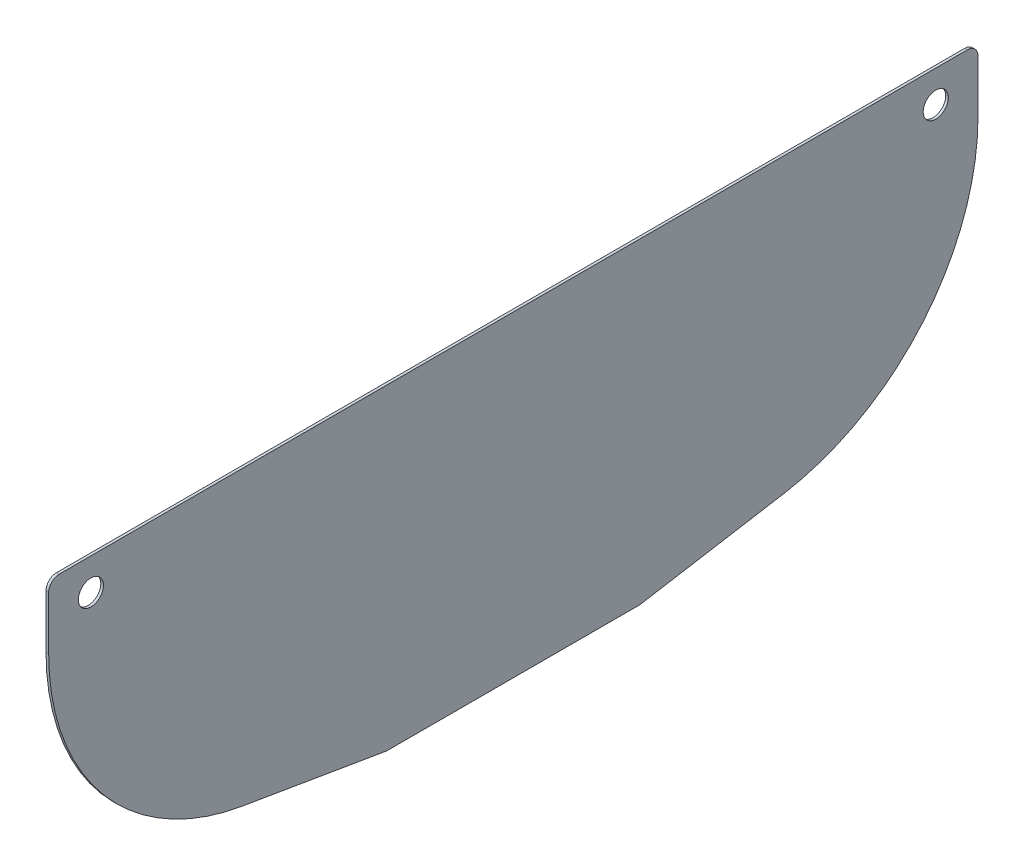
ISO-10303-21;
HEADER;
FILE_DESCRIPTION(('STEP AP214'),'2;1');
FILE_NAME('part.step','',(''),(''),'','','');
FILE_SCHEMA(('AUTOMOTIVE_DESIGN { 1 0 10303 214 1 1 1 1 }'));
ENDSEC;
DATA;
#1=APPLICATION_CONTEXT('core data for automotive mechanical design processes');
#2=APPLICATION_PROTOCOL_DEFINITION('international standard','automotive_design',2000,#1);
#3=PRODUCT_CONTEXT('',#1,'mechanical');
#4=PRODUCT('Part','Part','',(#3));
#5=PRODUCT_RELATED_PRODUCT_CATEGORY('part','',(#4));
#6=PRODUCT_DEFINITION_FORMATION('','',#4);
#7=PRODUCT_DEFINITION_CONTEXT('part definition',#1,'design');
#8=PRODUCT_DEFINITION('design','',#6,#7);
#9=PRODUCT_DEFINITION_SHAPE('','',#8);
#10=(LENGTH_UNIT() NAMED_UNIT(*) SI_UNIT(.MILLI.,.METRE.));
#11=(NAMED_UNIT(*) PLANE_ANGLE_UNIT() SI_UNIT($,.RADIAN.));
#12=(NAMED_UNIT(*) SI_UNIT($,.STERADIAN.) SOLID_ANGLE_UNIT());
#13=UNCERTAINTY_MEASURE_WITH_UNIT(LENGTH_MEASURE(1.E-05),#10,'distance_accuracy_value','');
#14=(GEOMETRIC_REPRESENTATION_CONTEXT(3) GLOBAL_UNCERTAINTY_ASSIGNED_CONTEXT((#13)) GLOBAL_UNIT_ASSIGNED_CONTEXT((#10,
#11,#12)) REPRESENTATION_CONTEXT('',''));
#15=CARTESIAN_POINT('',(0.,0.,0.));
#16=DIRECTION('',(0.,0.,1.));
#17=DIRECTION('',(1.,0.,0.));
#18=AXIS2_PLACEMENT_3D('',#15,#16,#17);
#19=CARTESIAN_POINT('',(3.175,609.6,-279.4));
#20=DIRECTION('',(1.,0.,0.));
#21=DIRECTION('',(0.,0.,-1.));
#22=AXIS2_PLACEMENT_3D('',#19,#20,#21);
#23=PLANE('',#22);
#24=CARTESIAN_POINT('',(3.175,647.7,508.));
#25=DIRECTION('',(1.,0.,0.));
#26=DIRECTION('',(0.,0.,-1.));
#27=AXIS2_PLACEMENT_3D('',#24,#25,#26);
#28=CIRCLE('',#27,15.08125);
#29=CARTESIAN_POINT('',(3.175,647.7,492.91875));
#30=VERTEX_POINT('',#29);
#31=EDGE_CURVE('E240',#30,#30,#28,.T.);
#32=ORIENTED_EDGE('',*,*,#31,.F.);
#33=EDGE_LOOP('',(#32));
#34=FACE_BOUND('',#33,.T.);
#35=DIRECTION('',(0.,0.,-1.));
#36=VECTOR('',#35,1.);
#37=CARTESIAN_POINT('',(3.175,304.8,-152.4));
#38=LINE('',#37,#36);
#39=CARTESIAN_POINT('',(3.175,304.8,151.335296477196));
#40=VERTEX_POINT('',#39);
#41=CARTESIAN_POINT('',(3.175,304.8,-151.335296477196));
#42=VERTEX_POINT('',#41);
#43=EDGE_CURVE('E233',#40,#42,#38,.T.);
#44=ORIENTED_EDGE('',*,*,#43,.T.);
#45=CARTESIAN_POINT('',(3.175,317.5,-151.335296477196));
#46=DIRECTION('',(1.,0.,0.));
#47=DIRECTION('',(0.,0.,-1.));
#48=AXIS2_PLACEMENT_3D('',#45,#46,#47);
#49=CIRCLE('',#48,12.7);
#50=CARTESIAN_POINT('',(3.175,304.977272750754,-153.449841875385));
#51=VERTEX_POINT('',#50);
#52=EDGE_CURVE('E179',#42,#51,#49,.T.);
#53=ORIENTED_EDGE('',*,*,#52,.T.);
#54=DIRECTION('',(0.,0.166499637652699,-0.986041515688625));
#55=VECTOR('',#54,1.);
#56=CARTESIAN_POINT('',(3.175,304.8,-152.4));
#57=LINE('',#56,#55);
#58=CARTESIAN_POINT('',(3.175,334.100000516598,-325.919998760164));
#59=VERTEX_POINT('',#58);
#60=EDGE_CURVE('E142',#51,#59,#57,.T.);
#61=ORIENTED_EDGE('',*,*,#60,.T.);
#62=CARTESIAN_POINT('',(3.175,609.6,-279.4));
#63=DIRECTION('',(1.,0.,0.));
#64=DIRECTION('',(0.,0.,-1.));
#65=AXIS2_PLACEMENT_3D('',#62,#63,#64);
#66=CIRCLE('',#65,279.4);
#67=CARTESIAN_POINT('',(3.175,609.6,-558.8));
#68=VERTEX_POINT('',#67);
#69=EDGE_CURVE('E136',#59,#68,#66,.T.);
#70=ORIENTED_EDGE('',*,*,#69,.T.);
#71=DIRECTION('',(0.,1.,0.));
#72=VECTOR('',#71,1.);
#73=CARTESIAN_POINT('',(3.175,685.8,-558.8));
#74=LINE('',#73,#72);
#75=CARTESIAN_POINT('',(3.175,673.1,-558.8));
#76=VERTEX_POINT('',#75);
#77=EDGE_CURVE('E126',#68,#76,#74,.T.);
#78=ORIENTED_EDGE('',*,*,#77,.T.);
#79=CARTESIAN_POINT('',(3.175,673.1,-546.1));
#80=DIRECTION('',(1.,0.,0.));
#81=DIRECTION('',(0.,0.,-1.));
#82=AXIS2_PLACEMENT_3D('',#79,#80,#81);
#83=CIRCLE('',#82,12.7);
#84=CARTESIAN_POINT('',(3.175,685.8,-546.1));
#85=VERTEX_POINT('',#84);
#86=EDGE_CURVE('E175',#76,#85,#83,.T.);
#87=ORIENTED_EDGE('',*,*,#86,.T.);
#88=DIRECTION('',(0.,0.,1.));
#89=VECTOR('',#88,1.);
#90=CARTESIAN_POINT('',(3.175,685.8,558.8));
#91=LINE('',#90,#89);
#92=CARTESIAN_POINT('',(3.175,685.8,546.1));
#93=VERTEX_POINT('',#92);
#94=EDGE_CURVE('E135',#85,#93,#91,.T.);
#95=ORIENTED_EDGE('',*,*,#94,.T.);
#96=CARTESIAN_POINT('',(3.175,673.1,546.1));
#97=DIRECTION('',(1.,0.,0.));
#98=DIRECTION('',(0.,0.,-1.));
#99=AXIS2_PLACEMENT_3D('',#96,#97,#98);
#100=CIRCLE('',#99,12.7);
#101=CARTESIAN_POINT('',(3.175,673.1,558.8));
#102=VERTEX_POINT('',#101);
#103=EDGE_CURVE('E57',#93,#102,#100,.T.);
#104=ORIENTED_EDGE('',*,*,#103,.T.);
#105=DIRECTION('',(0.,-1.,0.));
#106=VECTOR('',#105,1.);
#107=CARTESIAN_POINT('',(3.175,609.6,558.8));
#108=LINE('',#107,#106);
#109=CARTESIAN_POINT('',(3.175,609.6,558.8));
#110=VERTEX_POINT('',#109);
#111=EDGE_CURVE('E254',#102,#110,#108,.T.);
#112=ORIENTED_EDGE('',*,*,#111,.T.);
#113=CARTESIAN_POINT('',(3.175,609.6,279.4));
#114=DIRECTION('',(1.,0.,0.));
#115=DIRECTION('',(0.,0.,1.));
#116=AXIS2_PLACEMENT_3D('',#113,#114,#115);
#117=CIRCLE('',#116,279.4);
#118=CARTESIAN_POINT('',(3.175,334.100000516598,325.919998760164));
#119=VERTEX_POINT('',#118);
#120=EDGE_CURVE('E237',#110,#119,#117,.T.);
#121=ORIENTED_EDGE('',*,*,#120,.T.);
#122=DIRECTION('',(0.,-0.166499637652699,-0.986041515688625));
#123=VECTOR('',#122,1.);
#124=CARTESIAN_POINT('',(3.175,304.8,152.4));
#125=LINE('',#124,#123);
#126=CARTESIAN_POINT('',(3.175,304.977272750754,153.449841875385));
#127=VERTEX_POINT('',#126);
#128=EDGE_CURVE('E220',#119,#127,#125,.T.);
#129=ORIENTED_EDGE('',*,*,#128,.T.);
#130=CARTESIAN_POINT('',(3.175,317.5,151.335296477196));
#131=DIRECTION('',(1.,0.,0.));
#132=DIRECTION('',(0.,0.,-1.));
#133=AXIS2_PLACEMENT_3D('',#130,#131,#132);
#134=CIRCLE('',#133,12.7);
#135=EDGE_CURVE('E177',#127,#40,#134,.T.);
#136=ORIENTED_EDGE('',*,*,#135,.T.);
#137=EDGE_LOOP('',(#44,#53,#61,#70,#78,#87,#95,#104,#112,#121,#129,#136));
#138=FACE_BOUND('',#137,.T.);
#139=CARTESIAN_POINT('',(3.175,647.7,-508.));
#140=DIRECTION('',(1.,0.,0.));
#141=DIRECTION('',(0.,0.,-1.));
#142=AXIS2_PLACEMENT_3D('',#139,#140,#141);
#143=CIRCLE('',#142,15.0812500000001);
#144=CARTESIAN_POINT('',(3.175,647.7,-523.08125));
#145=VERTEX_POINT('',#144);
#146=EDGE_CURVE('E247',#145,#145,#143,.T.);
#147=ORIENTED_EDGE('',*,*,#146,.F.);
#148=EDGE_LOOP('',(#147));
#149=FACE_BOUND('',#148,.T.);
#150=ADVANCED_FACE('F34',(#34,#138,#149),#23,.T.);
#151=CARTESIAN_POINT('',(0.,609.6,-279.4));
#152=DIRECTION('',(1.,0.,0.));
#153=DIRECTION('',(0.,0.,-1.));
#154=AXIS2_PLACEMENT_3D('',#151,#152,#153);
#155=PLANE('',#154);
#156=DIRECTION('',(0.,0.166499637652699,-0.986041515688625));
#157=VECTOR('',#156,1.);
#158=CARTESIAN_POINT('',(0.,304.8,-152.4));
#159=LINE('',#158,#157);
#160=CARTESIAN_POINT('',(0.,304.977272750754,-153.449841875385));
#161=VERTEX_POINT('',#160);
#162=CARTESIAN_POINT('',(0.,334.100000516598,-325.919998760164));
#163=VERTEX_POINT('',#162);
#164=EDGE_CURVE('E146',#161,#163,#159,.T.);
#165=ORIENTED_EDGE('',*,*,#164,.F.);
#166=CARTESIAN_POINT('',(0.,317.5,-151.335296477196));
#167=DIRECTION('',(1.,0.,0.));
#168=DIRECTION('',(0.,0.,-1.));
#169=AXIS2_PLACEMENT_3D('',#166,#167,#168);
#170=CIRCLE('',#169,12.7);
#171=CARTESIAN_POINT('',(0.,304.8,-151.335296477196));
#172=VERTEX_POINT('',#171);
#173=EDGE_CURVE('E167',#161,#172,#170,.F.);
#174=ORIENTED_EDGE('',*,*,#173,.T.);
#175=DIRECTION('',(0.,0.,-1.));
#176=VECTOR('',#175,1.);
#177=CARTESIAN_POINT('',(0.,304.8,-152.4));
#178=LINE('',#177,#176);
#179=CARTESIAN_POINT('',(0.,304.8,151.335296477196));
#180=VERTEX_POINT('',#179);
#181=EDGE_CURVE('E211',#180,#172,#178,.T.);
#182=ORIENTED_EDGE('',*,*,#181,.F.);
#183=CARTESIAN_POINT('',(0.,317.5,151.335296477196));
#184=DIRECTION('',(1.,0.,0.));
#185=DIRECTION('',(0.,0.,-1.));
#186=AXIS2_PLACEMENT_3D('',#183,#184,#185);
#187=CIRCLE('',#186,12.7);
#188=CARTESIAN_POINT('',(0.,304.977272750754,153.449841875385));
#189=VERTEX_POINT('',#188);
#190=EDGE_CURVE('E165',#180,#189,#187,.F.);
#191=ORIENTED_EDGE('',*,*,#190,.T.);
#192=DIRECTION('',(0.,-0.166499637652699,-0.986041515688625));
#193=VECTOR('',#192,1.);
#194=CARTESIAN_POINT('',(0.,304.8,152.4));
#195=LINE('',#194,#193);
#196=CARTESIAN_POINT('',(0.,334.100000516598,325.919998760164));
#197=VERTEX_POINT('',#196);
#198=EDGE_CURVE('E209',#197,#189,#195,.T.);
#199=ORIENTED_EDGE('',*,*,#198,.F.);
#200=CARTESIAN_POINT('',(0.,609.6,279.4));
#201=DIRECTION('',(1.,0.,0.));
#202=DIRECTION('',(0.,0.,1.));
#203=AXIS2_PLACEMENT_3D('',#200,#201,#202);
#204=CIRCLE('',#203,279.4);
#205=CARTESIAN_POINT('',(0.,609.6,558.8));
#206=VERTEX_POINT('',#205);
#207=EDGE_CURVE('E203',#206,#197,#204,.T.);
#208=ORIENTED_EDGE('',*,*,#207,.F.);
#209=DIRECTION('',(0.,-1.,0.));
#210=VECTOR('',#209,1.);
#211=CARTESIAN_POINT('',(0.,609.6,558.8));
#212=LINE('',#211,#210);
#213=CARTESIAN_POINT('',(0.,673.1,558.8));
#214=VERTEX_POINT('',#213);
#215=EDGE_CURVE('E200',#214,#206,#212,.T.);
#216=ORIENTED_EDGE('',*,*,#215,.F.);
#217=CARTESIAN_POINT('',(0.,673.1,546.1));
#218=DIRECTION('',(1.,0.,0.));
#219=DIRECTION('',(0.,0.,-1.));
#220=AXIS2_PLACEMENT_3D('',#217,#218,#219);
#221=CIRCLE('',#220,12.7);
#222=CARTESIAN_POINT('',(0.,685.8,546.1));
#223=VERTEX_POINT('',#222);
#224=EDGE_CURVE('E155',#214,#223,#221,.F.);
#225=ORIENTED_EDGE('',*,*,#224,.T.);
#226=DIRECTION('',(0.,0.,1.));
#227=VECTOR('',#226,1.);
#228=CARTESIAN_POINT('',(0.,685.8,558.8));
#229=LINE('',#228,#227);
#230=CARTESIAN_POINT('',(0.,685.8,-546.1));
#231=VERTEX_POINT('',#230);
#232=EDGE_CURVE('E192',#231,#223,#229,.T.);
#233=ORIENTED_EDGE('',*,*,#232,.F.);
#234=CARTESIAN_POINT('',(0.,673.1,-546.1));
#235=DIRECTION('',(1.,0.,0.));
#236=DIRECTION('',(0.,0.,-1.));
#237=AXIS2_PLACEMENT_3D('',#234,#235,#236);
#238=CIRCLE('',#237,12.7);
#239=CARTESIAN_POINT('',(0.,673.1,-558.8));
#240=VERTEX_POINT('',#239);
#241=EDGE_CURVE('E163',#231,#240,#238,.F.);
#242=ORIENTED_EDGE('',*,*,#241,.T.);
#243=DIRECTION('',(0.,1.,0.));
#244=VECTOR('',#243,1.);
#245=CARTESIAN_POINT('',(0.,685.8,-558.8));
#246=LINE('',#245,#244);
#247=CARTESIAN_POINT('',(0.,609.6,-558.8));
#248=VERTEX_POINT('',#247);
#249=EDGE_CURVE('E201',#248,#240,#246,.T.);
#250=ORIENTED_EDGE('',*,*,#249,.F.);
#251=CARTESIAN_POINT('',(0.,609.6,-279.4));
#252=DIRECTION('',(1.,0.,0.));
#253=DIRECTION('',(0.,0.,-1.));
#254=AXIS2_PLACEMENT_3D('',#251,#252,#253);
#255=CIRCLE('',#254,279.4);
#256=EDGE_CURVE('E150',#163,#248,#255,.T.);
#257=ORIENTED_EDGE('',*,*,#256,.F.);
#258=EDGE_LOOP('',(#165,#174,#182,#191,#199,#208,#216,#225,#233,#242,#250,#257));
#259=FACE_BOUND('',#258,.T.);
#260=CARTESIAN_POINT('',(0.,647.7,508.));
#261=DIRECTION('',(1.,0.,0.));
#262=DIRECTION('',(0.,0.,-1.));
#263=AXIS2_PLACEMENT_3D('',#260,#261,#262);
#264=CIRCLE('',#263,15.08125);
#265=CARTESIAN_POINT('',(0.,647.7,492.91875));
#266=VERTEX_POINT('',#265);
#267=EDGE_CURVE('E242',#266,#266,#264,.T.);
#268=ORIENTED_EDGE('',*,*,#267,.T.);
#269=EDGE_LOOP('',(#268));
#270=FACE_BOUND('',#269,.T.);
#271=CARTESIAN_POINT('',(0.,647.7,-508.));
#272=DIRECTION('',(1.,0.,0.));
#273=DIRECTION('',(0.,0.,-1.));
#274=AXIS2_PLACEMENT_3D('',#271,#272,#273);
#275=CIRCLE('',#274,15.0812500000001);
#276=CARTESIAN_POINT('',(0.,647.7,-523.08125));
#277=VERTEX_POINT('',#276);
#278=EDGE_CURVE('E250',#277,#277,#275,.T.);
#279=ORIENTED_EDGE('',*,*,#278,.T.);
#280=EDGE_LOOP('',(#279));
#281=FACE_BOUND('',#280,.T.);
#282=ADVANCED_FACE('F197',(#259,#270,#281),#155,.F.);
#283=CARTESIAN_POINT('',(3.175,609.6,-279.4));
#284=DIRECTION('',(-1.,0.,0.));
#285=DIRECTION('',(0.,0.,1.));
#286=AXIS2_PLACEMENT_3D('',#283,#284,#285);
#287=CYLINDRICAL_SURFACE('',#286,279.4);
#288=ORIENTED_EDGE('',*,*,#256,.T.);
#289=DIRECTION('',(-1.,0.,0.));
#290=VECTOR('',#289,1.);
#291=CARTESIAN_POINT('',(3.175,609.6,-558.8));
#292=LINE('',#291,#290);
#293=EDGE_CURVE('E131',#68,#248,#292,.T.);
#294=ORIENTED_EDGE('',*,*,#293,.F.);
#295=ORIENTED_EDGE('',*,*,#69,.F.);
#296=DIRECTION('',(-1.,0.,0.));
#297=VECTOR('',#296,1.);
#298=CARTESIAN_POINT('',(3.175,334.100000516598,-325.919998760164));
#299=LINE('',#298,#297);
#300=EDGE_CURVE('E215',#59,#163,#299,.T.);
#301=ORIENTED_EDGE('',*,*,#300,.T.);
#302=EDGE_LOOP('',(#288,#294,#295,#301));
#303=FACE_BOUND('',#302,.T.);
#304=ADVANCED_FACE('F148',(#303),#287,.T.);
#305=CARTESIAN_POINT('',(3.175,685.8,-558.8));
#306=DIRECTION('',(0.,0.,1.));
#307=DIRECTION('',(0.,-1.,0.));
#308=AXIS2_PLACEMENT_3D('',#305,#306,#307);
#309=PLANE('',#308);
#310=ORIENTED_EDGE('',*,*,#249,.T.);
#311=DIRECTION('',(-1.,0.,0.));
#312=VECTOR('',#311,1.);
#313=CARTESIAN_POINT('',(3.175,673.1,-558.8));
#314=LINE('',#313,#312);
#315=EDGE_CURVE('E42',#240,#76,#314,.F.);
#316=ORIENTED_EDGE('',*,*,#315,.T.);
#317=ORIENTED_EDGE('',*,*,#77,.F.);
#318=ORIENTED_EDGE('',*,*,#293,.T.);
#319=EDGE_LOOP('',(#310,#316,#317,#318));
#320=FACE_BOUND('',#319,.T.);
#321=ADVANCED_FACE('F129',(#320),#309,.F.);
#322=CARTESIAN_POINT('',(3.175,685.8,558.8));
#323=DIRECTION('',(0.,-1.,0.));
#324=DIRECTION('',(0.,0.,-1.));
#325=AXIS2_PLACEMENT_3D('',#322,#323,#324);
#326=PLANE('',#325);
#327=ORIENTED_EDGE('',*,*,#94,.F.);
#328=DIRECTION('',(-1.,0.,0.));
#329=VECTOR('',#328,1.);
#330=CARTESIAN_POINT('',(3.175,685.8,-546.1));
#331=LINE('',#330,#329);
#332=EDGE_CURVE('E184',#85,#231,#331,.T.);
#333=ORIENTED_EDGE('',*,*,#332,.T.);
#334=ORIENTED_EDGE('',*,*,#232,.T.);
#335=DIRECTION('',(-1.,0.,0.));
#336=VECTOR('',#335,1.);
#337=CARTESIAN_POINT('',(3.175,685.8,546.1));
#338=LINE('',#337,#336);
#339=EDGE_CURVE('E182',#223,#93,#338,.F.);
#340=ORIENTED_EDGE('',*,*,#339,.T.);
#341=EDGE_LOOP('',(#327,#333,#334,#340));
#342=FACE_BOUND('',#341,.T.);
#343=ADVANCED_FACE('F191',(#342),#326,.F.);
#344=CARTESIAN_POINT('',(3.175,609.6,558.8));
#345=DIRECTION('',(0.,0.,-1.));
#346=DIRECTION('',(0.,1.,0.));
#347=AXIS2_PLACEMENT_3D('',#344,#345,#346);
#348=PLANE('',#347);
#349=ORIENTED_EDGE('',*,*,#111,.F.);
#350=DIRECTION('',(-1.,0.,0.));
#351=VECTOR('',#350,1.);
#352=CARTESIAN_POINT('',(3.175,673.1,558.8));
#353=LINE('',#352,#351);
#354=EDGE_CURVE('E11',#102,#214,#353,.T.);
#355=ORIENTED_EDGE('',*,*,#354,.T.);
#356=ORIENTED_EDGE('',*,*,#215,.T.);
#357=DIRECTION('',(-1.,0.,0.));
#358=VECTOR('',#357,1.);
#359=CARTESIAN_POINT('',(3.175,609.6,558.8));
#360=LINE('',#359,#358);
#361=EDGE_CURVE('E152',#110,#206,#360,.T.);
#362=ORIENTED_EDGE('',*,*,#361,.F.);
#363=EDGE_LOOP('',(#349,#355,#356,#362));
#364=FACE_BOUND('',#363,.T.);
#365=ADVANCED_FACE('F258',(#364),#348,.F.);
#366=CARTESIAN_POINT('',(3.175,609.6,279.4));
#367=DIRECTION('',(-1.,0.,0.));
#368=DIRECTION('',(0.,0.,1.));
#369=AXIS2_PLACEMENT_3D('',#366,#367,#368);
#370=CYLINDRICAL_SURFACE('',#369,279.4);
#371=ORIENTED_EDGE('',*,*,#207,.T.);
#372=DIRECTION('',(-1.,0.,0.));
#373=VECTOR('',#372,1.);
#374=CARTESIAN_POINT('',(3.175,334.100000516598,325.919998760164));
#375=LINE('',#374,#373);
#376=EDGE_CURVE('E158',#119,#197,#375,.T.);
#377=ORIENTED_EDGE('',*,*,#376,.F.);
#378=ORIENTED_EDGE('',*,*,#120,.F.);
#379=ORIENTED_EDGE('',*,*,#361,.T.);
#380=EDGE_LOOP('',(#371,#377,#378,#379));
#381=FACE_BOUND('',#380,.T.);
#382=ADVANCED_FACE('F256',(#381),#370,.T.);
#383=CARTESIAN_POINT('',(3.175,304.8,152.4));
#384=DIRECTION('',(0.,0.986041515688625,-0.166499637652699));
#385=DIRECTION('',(0.,0.166499637652699,0.986041515688625));
#386=AXIS2_PLACEMENT_3D('',#383,#384,#385);
#387=PLANE('',#386);
#388=ORIENTED_EDGE('',*,*,#198,.T.);
#389=DIRECTION('',(-1.,0.,0.));
#390=VECTOR('',#389,1.);
#391=CARTESIAN_POINT('',(3.175,304.977272750754,153.449841875385));
#392=LINE('',#391,#390);
#393=EDGE_CURVE('E49',#189,#127,#392,.F.);
#394=ORIENTED_EDGE('',*,*,#393,.T.);
#395=ORIENTED_EDGE('',*,*,#128,.F.);
#396=ORIENTED_EDGE('',*,*,#376,.T.);
#397=EDGE_LOOP('',(#388,#394,#395,#396));
#398=FACE_BOUND('',#397,.T.);
#399=ADVANCED_FACE('F219',(#398),#387,.F.);
#400=CARTESIAN_POINT('',(3.175,304.8,-152.4));
#401=DIRECTION('',(0.,1.,0.));
#402=DIRECTION('',(0.,0.,1.));
#403=AXIS2_PLACEMENT_3D('',#400,#401,#402);
#404=PLANE('',#403);
#405=ORIENTED_EDGE('',*,*,#181,.T.);
#406=DIRECTION('',(-1.,0.,0.));
#407=VECTOR('',#406,1.);
#408=CARTESIAN_POINT('',(3.175,304.8,-151.335296477196));
#409=LINE('',#408,#407);
#410=EDGE_CURVE('E172',#172,#42,#409,.F.);
#411=ORIENTED_EDGE('',*,*,#410,.T.);
#412=ORIENTED_EDGE('',*,*,#43,.F.);
#413=DIRECTION('',(-1.,0.,0.));
#414=VECTOR('',#413,1.);
#415=CARTESIAN_POINT('',(3.175,304.8,151.335296477196));
#416=LINE('',#415,#414);
#417=EDGE_CURVE('E169',#40,#180,#416,.T.);
#418=ORIENTED_EDGE('',*,*,#417,.T.);
#419=EDGE_LOOP('',(#405,#411,#412,#418));
#420=FACE_BOUND('',#419,.T.);
#421=ADVANCED_FACE('F231',(#420),#404,.F.);
#422=CARTESIAN_POINT('',(3.175,304.8,-152.4));
#423=DIRECTION('',(0.,0.986041515688625,0.166499637652699));
#424=DIRECTION('',(0.,-0.166499637652699,0.986041515688625));
#425=AXIS2_PLACEMENT_3D('',#422,#423,#424);
#426=PLANE('',#425);
#427=ORIENTED_EDGE('',*,*,#60,.F.);
#428=DIRECTION('',(-1.,0.,0.));
#429=VECTOR('',#428,1.);
#430=CARTESIAN_POINT('',(3.175,304.977272750754,-153.449841875385));
#431=LINE('',#430,#429);
#432=EDGE_CURVE('E151',#51,#161,#431,.T.);
#433=ORIENTED_EDGE('',*,*,#432,.T.);
#434=ORIENTED_EDGE('',*,*,#164,.T.);
#435=ORIENTED_EDGE('',*,*,#300,.F.);
#436=EDGE_LOOP('',(#427,#433,#434,#435));
#437=FACE_BOUND('',#436,.T.);
#438=ADVANCED_FACE('F280',(#437),#426,.F.);
#439=CARTESIAN_POINT('',(3.175,647.7,508.));
#440=DIRECTION('',(-1.,0.,0.));
#441=DIRECTION('',(0.,0.,1.));
#442=AXIS2_PLACEMENT_3D('',#439,#440,#441);
#443=CYLINDRICAL_SURFACE('',#442,15.08125);
#444=ORIENTED_EDGE('',*,*,#31,.T.);
#445=EDGE_LOOP('',(#444));
#446=FACE_BOUND('',#445,.T.);
#447=ORIENTED_EDGE('',*,*,#267,.F.);
#448=EDGE_LOOP('',(#447));
#449=FACE_BOUND('',#448,.T.);
#450=ADVANCED_FACE('F277',(#446,#449),#443,.F.);
#451=CARTESIAN_POINT('',(3.175,647.7,-508.));
#452=DIRECTION('',(-1.,0.,0.));
#453=DIRECTION('',(0.,0.,1.));
#454=AXIS2_PLACEMENT_3D('',#451,#452,#453);
#455=CYLINDRICAL_SURFACE('',#454,15.0812500000001);
#456=ORIENTED_EDGE('',*,*,#146,.T.);
#457=EDGE_LOOP('',(#456));
#458=FACE_BOUND('',#457,.T.);
#459=ORIENTED_EDGE('',*,*,#278,.F.);
#460=EDGE_LOOP('',(#459));
#461=FACE_BOUND('',#460,.T.);
#462=ADVANCED_FACE('F299',(#458,#461),#455,.F.);
#463=CARTESIAN_POINT('',(3.175,317.5,-151.335296477196));
#464=DIRECTION('',(-1.,0.,0.));
#465=DIRECTION('',(0.,0.,1.));
#466=AXIS2_PLACEMENT_3D('',#463,#464,#465);
#467=CYLINDRICAL_SURFACE('',#466,12.7);
#468=ORIENTED_EDGE('',*,*,#52,.F.);
#469=ORIENTED_EDGE('',*,*,#410,.F.);
#470=ORIENTED_EDGE('',*,*,#173,.F.);
#471=ORIENTED_EDGE('',*,*,#432,.F.);
#472=EDGE_LOOP('',(#468,#469,#470,#471));
#473=FACE_BOUND('',#472,.T.);
#474=ADVANCED_FACE('F267',(#473),#467,.T.);
#475=CARTESIAN_POINT('',(3.175,317.5,151.335296477196));
#476=DIRECTION('',(-1.,0.,0.));
#477=DIRECTION('',(0.,0.,1.));
#478=AXIS2_PLACEMENT_3D('',#475,#476,#477);
#479=CYLINDRICAL_SURFACE('',#478,12.7);
#480=ORIENTED_EDGE('',*,*,#135,.F.);
#481=ORIENTED_EDGE('',*,*,#393,.F.);
#482=ORIENTED_EDGE('',*,*,#190,.F.);
#483=ORIENTED_EDGE('',*,*,#417,.F.);
#484=EDGE_LOOP('',(#480,#481,#482,#483));
#485=FACE_BOUND('',#484,.T.);
#486=ADVANCED_FACE('F228',(#485),#479,.T.);
#487=CARTESIAN_POINT('',(3.175,673.1,-546.1));
#488=DIRECTION('',(-1.,0.,0.));
#489=DIRECTION('',(0.,0.,1.));
#490=AXIS2_PLACEMENT_3D('',#487,#488,#489);
#491=CYLINDRICAL_SURFACE('',#490,12.7);
#492=ORIENTED_EDGE('',*,*,#86,.F.);
#493=ORIENTED_EDGE('',*,*,#315,.F.);
#494=ORIENTED_EDGE('',*,*,#241,.F.);
#495=ORIENTED_EDGE('',*,*,#332,.F.);
#496=EDGE_LOOP('',(#492,#493,#494,#495));
#497=FACE_BOUND('',#496,.T.);
#498=ADVANCED_FACE('F261',(#497),#491,.T.);
#499=CARTESIAN_POINT('',(3.175,673.1,546.1));
#500=DIRECTION('',(-1.,0.,0.));
#501=DIRECTION('',(0.,0.,1.));
#502=AXIS2_PLACEMENT_3D('',#499,#500,#501);
#503=CYLINDRICAL_SURFACE('',#502,12.7);
#504=ORIENTED_EDGE('',*,*,#103,.F.);
#505=ORIENTED_EDGE('',*,*,#339,.F.);
#506=ORIENTED_EDGE('',*,*,#224,.F.);
#507=ORIENTED_EDGE('',*,*,#354,.F.);
#508=EDGE_LOOP('',(#504,#505,#506,#507));
#509=FACE_BOUND('',#508,.T.);
#510=ADVANCED_FACE('F36',(#509),#503,.T.);
#511=CLOSED_SHELL('',(#150,#282,#304,#321,#343,#365,#382,#399,#421,#438,#450,#462,#474,#486,
#498,#510));
#512=MANIFOLD_SOLID_BREP('B2',#511);
#513=ADVANCED_BREP_SHAPE_REPRESENTATION('',(#18,#512),#14);
#514=SHAPE_DEFINITION_REPRESENTATION(#9,#513);
ENDSEC;
END-ISO-10303-21;
